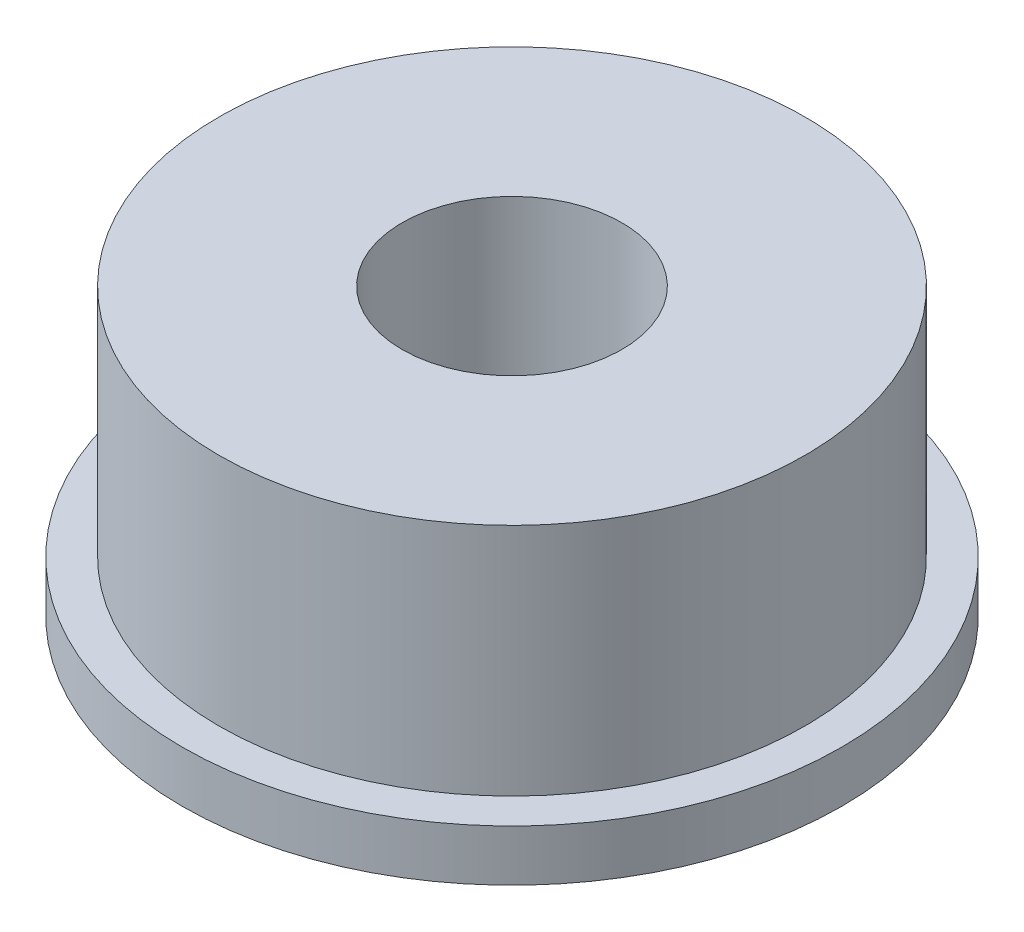
ISO-10303-21;
HEADER;
FILE_DESCRIPTION(('STEP AP214'),'2;1');
FILE_NAME('part.step','',(''),(''),'','','');
FILE_SCHEMA(('AUTOMOTIVE_DESIGN { 1 0 10303 214 1 1 1 1 }'));
ENDSEC;
DATA;
#1=APPLICATION_CONTEXT('core data for automotive mechanical design processes');
#2=APPLICATION_PROTOCOL_DEFINITION('international standard','automotive_design',2000,#1);
#3=PRODUCT_CONTEXT('',#1,'mechanical');
#4=PRODUCT('Part','Part','',(#3));
#5=PRODUCT_RELATED_PRODUCT_CATEGORY('part','',(#4));
#6=PRODUCT_DEFINITION_FORMATION('','',#4);
#7=PRODUCT_DEFINITION_CONTEXT('part definition',#1,'design');
#8=PRODUCT_DEFINITION('design','',#6,#7);
#9=PRODUCT_DEFINITION_SHAPE('','',#8);
#10=(LENGTH_UNIT() NAMED_UNIT(*) SI_UNIT(.MILLI.,.METRE.));
#11=(NAMED_UNIT(*) PLANE_ANGLE_UNIT() SI_UNIT($,.RADIAN.));
#12=(NAMED_UNIT(*) SI_UNIT($,.STERADIAN.) SOLID_ANGLE_UNIT());
#13=UNCERTAINTY_MEASURE_WITH_UNIT(LENGTH_MEASURE(1.E-05),#10,'distance_accuracy_value','');
#14=(GEOMETRIC_REPRESENTATION_CONTEXT(3) GLOBAL_UNCERTAINTY_ASSIGNED_CONTEXT((#13)) GLOBAL_UNIT_ASSIGNED_CONTEXT((#10,
#11,#12)) REPRESENTATION_CONTEXT('',''));
#15=CARTESIAN_POINT('',(0.,0.,0.));
#16=DIRECTION('',(0.,0.,1.));
#17=DIRECTION('',(1.,0.,0.));
#18=AXIS2_PLACEMENT_3D('',#15,#16,#17);
#19=CARTESIAN_POINT('',(0.,0.7,0.));
#20=DIRECTION('',(0.,-1.,0.));
#21=DIRECTION('',(0.,0.,-1.));
#22=AXIS2_PLACEMENT_3D('',#19,#20,#21);
#23=CYLINDRICAL_SURFACE('',#22,4.5);
#24=CARTESIAN_POINT('',(0.,0.7,0.));
#25=DIRECTION('',(0.,1.,0.));
#26=DIRECTION('',(0.,0.,1.));
#27=AXIS2_PLACEMENT_3D('',#24,#25,#26);
#28=CIRCLE('',#27,4.5);
#29=CARTESIAN_POINT('',(0.,0.7,4.5));
#30=VERTEX_POINT('',#29);
#31=EDGE_CURVE('E37',#30,#30,#28,.T.);
#32=ORIENTED_EDGE('',*,*,#31,.F.);
#33=EDGE_LOOP('',(#32));
#34=FACE_BOUND('',#33,.T.);
#35=CARTESIAN_POINT('',(0.,0.,0.));
#36=DIRECTION('',(0.,1.,0.));
#37=DIRECTION('',(0.,0.,1.));
#38=AXIS2_PLACEMENT_3D('',#35,#36,#37);
#39=CIRCLE('',#38,4.5);
#40=CARTESIAN_POINT('',(0.,0.,4.5));
#41=VERTEX_POINT('',#40);
#42=EDGE_CURVE('E33',#41,#41,#39,.T.);
#43=ORIENTED_EDGE('',*,*,#42,.T.);
#44=EDGE_LOOP('',(#43));
#45=FACE_BOUND('',#44,.T.);
#46=ADVANCED_FACE('F30',(#34,#45),#23,.T.);
#47=CARTESIAN_POINT('',(0.,0.7,0.));
#48=DIRECTION('',(0.,1.,0.));
#49=DIRECTION('',(0.,0.,1.));
#50=AXIS2_PLACEMENT_3D('',#47,#48,#49);
#51=PLANE('',#50);
#52=CARTESIAN_POINT('',(0.,0.7,0.));
#53=DIRECTION('',(0.,1.,0.));
#54=DIRECTION('',(0.,0.,1.));
#55=AXIS2_PLACEMENT_3D('',#52,#53,#54);
#56=CIRCLE('',#55,4.);
#57=CARTESIAN_POINT('',(0.,0.7,4.));
#58=VERTEX_POINT('',#57);
#59=EDGE_CURVE('E10',#58,#58,#56,.T.);
#60=ORIENTED_EDGE('',*,*,#59,.F.);
#61=EDGE_LOOP('',(#60));
#62=FACE_BOUND('',#61,.T.);
#63=ORIENTED_EDGE('',*,*,#31,.T.);
#64=EDGE_LOOP('',(#63));
#65=FACE_BOUND('',#64,.T.);
#66=ADVANCED_FACE('F74',(#62,#65),#51,.T.);
#67=CARTESIAN_POINT('',(0.,0.,0.));
#68=DIRECTION('',(0.,1.,0.));
#69=DIRECTION('',(0.,0.,1.));
#70=AXIS2_PLACEMENT_3D('',#67,#68,#69);
#71=PLANE('',#70);
#72=CARTESIAN_POINT('',(0.,0.,0.));
#73=DIRECTION('',(0.,1.,0.));
#74=DIRECTION('',(0.,0.,1.));
#75=AXIS2_PLACEMENT_3D('',#72,#73,#74);
#76=CIRCLE('',#75,1.5);
#77=CARTESIAN_POINT('',(0.,0.,1.5));
#78=VERTEX_POINT('',#77);
#79=EDGE_CURVE('E46',#78,#78,#76,.T.);
#80=ORIENTED_EDGE('',*,*,#79,.T.);
#81=EDGE_LOOP('',(#80));
#82=FACE_BOUND('',#81,.T.);
#83=ORIENTED_EDGE('',*,*,#42,.F.);
#84=EDGE_LOOP('',(#83));
#85=FACE_BOUND('',#84,.T.);
#86=ADVANCED_FACE('F53',(#82,#85),#71,.F.);
#87=CARTESIAN_POINT('',(0.,3.9,0.));
#88=DIRECTION('',(0.,-1.,0.));
#89=DIRECTION('',(0.,0.,-1.));
#90=AXIS2_PLACEMENT_3D('',#87,#88,#89);
#91=CYLINDRICAL_SURFACE('',#90,4.);
#92=CARTESIAN_POINT('',(0.,3.9,0.));
#93=DIRECTION('',(0.,1.,0.));
#94=DIRECTION('',(0.,0.,1.));
#95=AXIS2_PLACEMENT_3D('',#92,#93,#94);
#96=CIRCLE('',#95,4.);
#97=CARTESIAN_POINT('',(0.,3.9,4.));
#98=VERTEX_POINT('',#97);
#99=EDGE_CURVE('E43',#98,#98,#96,.T.);
#100=ORIENTED_EDGE('',*,*,#99,.F.);
#101=EDGE_LOOP('',(#100));
#102=FACE_BOUND('',#101,.T.);
#103=ORIENTED_EDGE('',*,*,#59,.T.);
#104=EDGE_LOOP('',(#103));
#105=FACE_BOUND('',#104,.T.);
#106=ADVANCED_FACE('F65',(#102,#105),#91,.T.);
#107=CARTESIAN_POINT('',(0.,3.9,0.));
#108=DIRECTION('',(0.,1.,0.));
#109=DIRECTION('',(0.,0.,1.));
#110=AXIS2_PLACEMENT_3D('',#107,#108,#109);
#111=PLANE('',#110);
#112=CARTESIAN_POINT('',(0.,3.9,0.));
#113=DIRECTION('',(0.,1.,0.));
#114=DIRECTION('',(0.,0.,1.));
#115=AXIS2_PLACEMENT_3D('',#112,#113,#114);
#116=CIRCLE('',#115,1.5);
#117=CARTESIAN_POINT('',(0.,3.9,1.5));
#118=VERTEX_POINT('',#117);
#119=EDGE_CURVE('E47',#118,#118,#116,.T.);
#120=ORIENTED_EDGE('',*,*,#119,.F.);
#121=EDGE_LOOP('',(#120));
#122=FACE_BOUND('',#121,.T.);
#123=ORIENTED_EDGE('',*,*,#99,.T.);
#124=EDGE_LOOP('',(#123));
#125=FACE_BOUND('',#124,.T.);
#126=ADVANCED_FACE('F59',(#122,#125),#111,.T.);
#127=CARTESIAN_POINT('',(0.,0.,0.));
#128=DIRECTION('',(0.,1.,0.));
#129=DIRECTION('',(0.,0.,1.));
#130=AXIS2_PLACEMENT_3D('',#127,#128,#129);
#131=CYLINDRICAL_SURFACE('',#130,1.5);
#132=ORIENTED_EDGE('',*,*,#79,.F.);
#133=EDGE_LOOP('',(#132));
#134=FACE_BOUND('',#133,.T.);
#135=ORIENTED_EDGE('',*,*,#119,.T.);
#136=EDGE_LOOP('',(#135));
#137=FACE_BOUND('',#136,.T.);
#138=ADVANCED_FACE('F56',(#134,#137),#131,.F.);
#139=CLOSED_SHELL('',(#46,#66,#86,#106,#126,#138));
#140=MANIFOLD_SOLID_BREP('B2',#139);
#141=ADVANCED_BREP_SHAPE_REPRESENTATION('',(#18,#140),#14);
#142=SHAPE_DEFINITION_REPRESENTATION(#9,#141);
ENDSEC;
END-ISO-10303-21;
